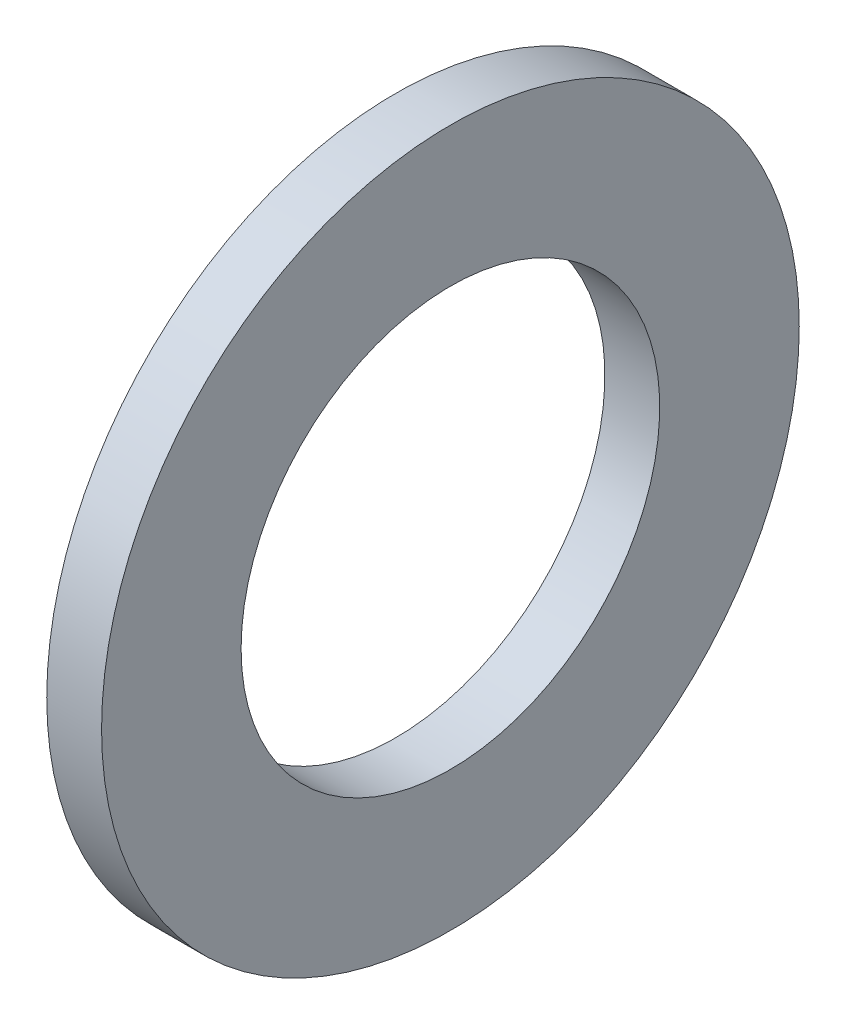
ISO-10303-21;
HEADER;
FILE_DESCRIPTION(('STEP AP214'),'2;1');
FILE_NAME('part.step','',(''),(''),'','','');
FILE_SCHEMA(('AUTOMOTIVE_DESIGN { 1 0 10303 214 1 1 1 1 }'));
ENDSEC;
DATA;
#1=APPLICATION_CONTEXT('core data for automotive mechanical design processes');
#2=APPLICATION_PROTOCOL_DEFINITION('international standard','automotive_design',2000,#1);
#3=PRODUCT_CONTEXT('',#1,'mechanical');
#4=PRODUCT('Part','Part','',(#3));
#5=PRODUCT_RELATED_PRODUCT_CATEGORY('part','',(#4));
#6=PRODUCT_DEFINITION_FORMATION('','',#4);
#7=PRODUCT_DEFINITION_CONTEXT('part definition',#1,'design');
#8=PRODUCT_DEFINITION('design','',#6,#7);
#9=PRODUCT_DEFINITION_SHAPE('','',#8);
#10=(LENGTH_UNIT() NAMED_UNIT(*) SI_UNIT(.MILLI.,.METRE.));
#11=(NAMED_UNIT(*) PLANE_ANGLE_UNIT() SI_UNIT($,.RADIAN.));
#12=(NAMED_UNIT(*) SI_UNIT($,.STERADIAN.) SOLID_ANGLE_UNIT());
#13=UNCERTAINTY_MEASURE_WITH_UNIT(LENGTH_MEASURE(1.E-05),#10,'distance_accuracy_value','');
#14=(GEOMETRIC_REPRESENTATION_CONTEXT(3) GLOBAL_UNCERTAINTY_ASSIGNED_CONTEXT((#13)) GLOBAL_UNIT_ASSIGNED_CONTEXT((#10,
#11,#12)) REPRESENTATION_CONTEXT('',''));
#15=CARTESIAN_POINT('',(0.,0.,0.));
#16=DIRECTION('',(0.,0.,1.));
#17=DIRECTION('',(1.,0.,0.));
#18=AXIS2_PLACEMENT_3D('',#15,#16,#17);
#19=CARTESIAN_POINT('',(-3.75,17.5,0.));
#20=DIRECTION('',(1.,0.,0.));
#21=DIRECTION('',(0.,0.,-1.));
#22=AXIS2_PLACEMENT_3D('',#19,#20,#21);
#23=PLANE('',#22);
#24=CARTESIAN_POINT('',(-3.75,0.,0.));
#25=DIRECTION('',(-1.,0.,0.));
#26=DIRECTION('',(0.,0.,1.));
#27=AXIS2_PLACEMENT_3D('',#24,#25,#26);
#28=CIRCLE('',#27,10.5);
#29=CARTESIAN_POINT('',(-3.75,0.,10.5));
#30=VERTEX_POINT('',#29);
#31=EDGE_CURVE('E10',#30,#30,#28,.T.);
#32=ORIENTED_EDGE('',*,*,#31,.F.);
#33=EDGE_LOOP('',(#32));
#34=FACE_BOUND('',#33,.T.);
#35=CARTESIAN_POINT('',(-3.75,0.,0.));
#36=DIRECTION('',(-1.,0.,0.));
#37=DIRECTION('',(0.,0.,1.));
#38=AXIS2_PLACEMENT_3D('',#35,#36,#37);
#39=CIRCLE('',#38,17.5);
#40=CARTESIAN_POINT('',(-3.75,0.,17.5));
#41=VERTEX_POINT('',#40);
#42=EDGE_CURVE('E43',#41,#41,#39,.T.);
#43=ORIENTED_EDGE('',*,*,#42,.T.);
#44=EDGE_LOOP('',(#43));
#45=FACE_BOUND('',#44,.T.);
#46=ADVANCED_FACE('F29',(#34,#45),#23,.F.);
#47=CARTESIAN_POINT('',(50.,0.,0.));
#48=DIRECTION('',(-1.,0.,0.));
#49=DIRECTION('',(0.,0.,1.));
#50=AXIS2_PLACEMENT_3D('',#47,#48,#49);
#51=CYLINDRICAL_SURFACE('',#50,10.5);
#52=CARTESIAN_POINT('',(-1.,0.,0.));
#53=DIRECTION('',(-1.,0.,0.));
#54=DIRECTION('',(0.,0.,1.));
#55=AXIS2_PLACEMENT_3D('',#52,#53,#54);
#56=CIRCLE('',#55,10.5);
#57=CARTESIAN_POINT('',(-1.,0.,10.5));
#58=VERTEX_POINT('',#57);
#59=EDGE_CURVE('E35',#58,#58,#56,.T.);
#60=ORIENTED_EDGE('',*,*,#59,.F.);
#61=EDGE_LOOP('',(#60));
#62=FACE_BOUND('',#61,.T.);
#63=ORIENTED_EDGE('',*,*,#31,.T.);
#64=EDGE_LOOP('',(#63));
#65=FACE_BOUND('',#64,.T.);
#66=ADVANCED_FACE('F58',(#62,#65),#51,.F.);
#67=CARTESIAN_POINT('',(-1.,10.5,0.));
#68=DIRECTION('',(-1.,0.,0.));
#69=DIRECTION('',(0.,0.,1.));
#70=AXIS2_PLACEMENT_3D('',#67,#68,#69);
#71=PLANE('',#70);
#72=CARTESIAN_POINT('',(-1.,0.,0.));
#73=DIRECTION('',(-1.,0.,0.));
#74=DIRECTION('',(0.,0.,1.));
#75=AXIS2_PLACEMENT_3D('',#72,#73,#74);
#76=CIRCLE('',#75,17.5);
#77=CARTESIAN_POINT('',(-1.,0.,17.5));
#78=VERTEX_POINT('',#77);
#79=EDGE_CURVE('E39',#78,#78,#76,.T.);
#80=ORIENTED_EDGE('',*,*,#79,.F.);
#81=EDGE_LOOP('',(#80));
#82=FACE_BOUND('',#81,.T.);
#83=ORIENTED_EDGE('',*,*,#59,.T.);
#84=EDGE_LOOP('',(#83));
#85=FACE_BOUND('',#84,.T.);
#86=ADVANCED_FACE('F53',(#82,#85),#71,.F.);
#87=CARTESIAN_POINT('',(50.,0.,0.));
#88=DIRECTION('',(-1.,0.,0.));
#89=DIRECTION('',(0.,0.,1.));
#90=AXIS2_PLACEMENT_3D('',#87,#88,#89);
#91=CYLINDRICAL_SURFACE('',#90,17.5);
#92=ORIENTED_EDGE('',*,*,#42,.F.);
#93=EDGE_LOOP('',(#92));
#94=FACE_BOUND('',#93,.T.);
#95=ORIENTED_EDGE('',*,*,#79,.T.);
#96=EDGE_LOOP('',(#95));
#97=FACE_BOUND('',#96,.T.);
#98=ADVANCED_FACE('F50',(#94,#97),#91,.T.);
#99=CLOSED_SHELL('',(#46,#66,#86,#98));
#100=MANIFOLD_SOLID_BREP('B2',#99);
#101=ADVANCED_BREP_SHAPE_REPRESENTATION('',(#18,#100),#14);
#102=SHAPE_DEFINITION_REPRESENTATION(#9,#101);
ENDSEC;
END-ISO-10303-21;
